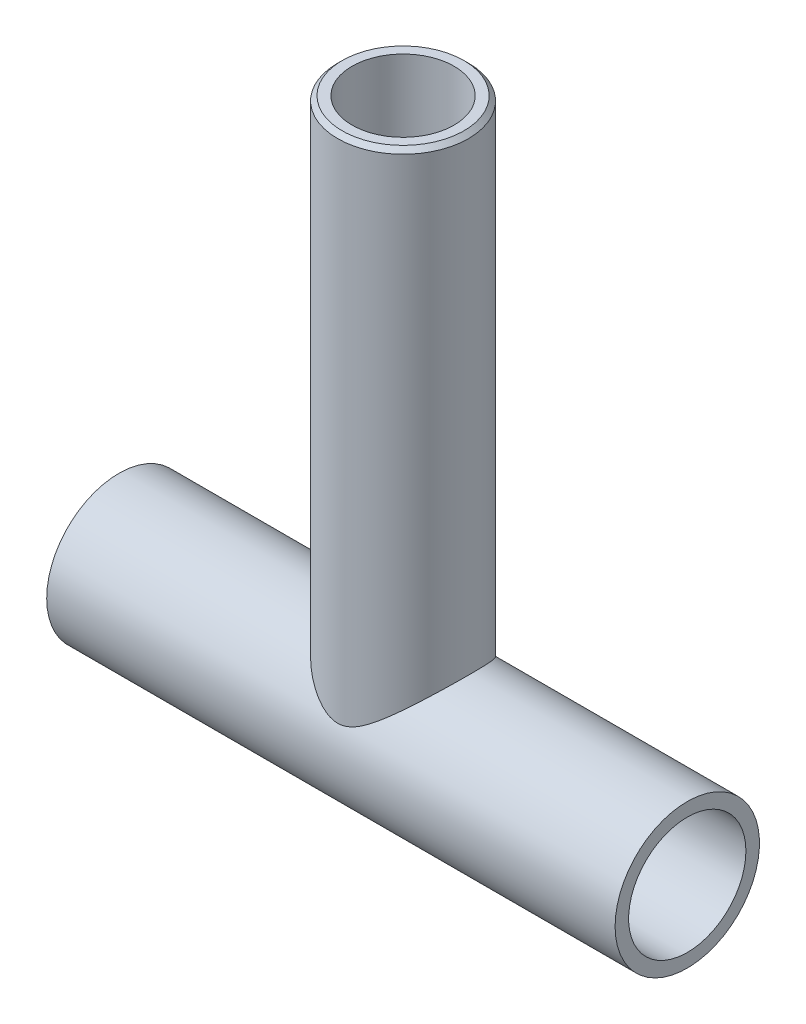
ISO-10303-21;
HEADER;
FILE_DESCRIPTION(('STEP AP214'),'2;1');
FILE_NAME('part.step','',(''),(''),'','','');
FILE_SCHEMA(('AUTOMOTIVE_DESIGN { 1 0 10303 214 1 1 1 1 }'));
ENDSEC;
DATA;
#1=APPLICATION_CONTEXT('core data for automotive mechanical design processes');
#2=APPLICATION_PROTOCOL_DEFINITION('international standard','automotive_design',2000,#1);
#3=PRODUCT_CONTEXT('',#1,'mechanical');
#4=PRODUCT('Part','Part','',(#3));
#5=PRODUCT_RELATED_PRODUCT_CATEGORY('part','',(#4));
#6=PRODUCT_DEFINITION_FORMATION('','',#4);
#7=PRODUCT_DEFINITION_CONTEXT('part definition',#1,'design');
#8=PRODUCT_DEFINITION('design','',#6,#7);
#9=PRODUCT_DEFINITION_SHAPE('','',#8);
#10=(LENGTH_UNIT() NAMED_UNIT(*) SI_UNIT(.MILLI.,.METRE.));
#11=(NAMED_UNIT(*) PLANE_ANGLE_UNIT() SI_UNIT($,.RADIAN.));
#12=(NAMED_UNIT(*) SI_UNIT($,.STERADIAN.) SOLID_ANGLE_UNIT());
#13=UNCERTAINTY_MEASURE_WITH_UNIT(LENGTH_MEASURE(1.E-05),#10,'distance_accuracy_value','');
#14=(GEOMETRIC_REPRESENTATION_CONTEXT(3) GLOBAL_UNCERTAINTY_ASSIGNED_CONTEXT((#13)) GLOBAL_UNIT_ASSIGNED_CONTEXT((#10,
#11,#12)) REPRESENTATION_CONTEXT('',''));
#15=CARTESIAN_POINT('',(0.,0.,0.));
#16=DIRECTION('',(0.,0.,1.));
#17=DIRECTION('',(1.,0.,0.));
#18=AXIS2_PLACEMENT_3D('',#15,#16,#17);
#19=CARTESIAN_POINT('',(63.,0.,0.));
#20=DIRECTION('',(-1.,0.,0.));
#21=DIRECTION('',(0.,0.,1.));
#22=AXIS2_PLACEMENT_3D('',#19,#20,#21);
#23=CYLINDRICAL_SURFACE('',#22,16.);
#24=CARTESIAN_POINT('',(0.,6.76387462923432,14.5));
#25=CARTESIAN_POINT('',(0.213106503792908,6.76387426027506,14.500000097715));
#26=CARTESIAN_POINT('',(0.426211669557894,6.77400596980977,14.4952868462218));
#27=CARTESIAN_POINT('',(0.850250078577055,6.81383250978955,14.4766072140147));
#28=CARTESIAN_POINT('',(1.06118211743942,6.84353765210637,14.462635955883));
#29=CARTESIAN_POINT('',(1.47956998334545,6.92074295345281,14.4258492811319));
#30=CARTESIAN_POINT('',(1.68701365344203,6.96829559726624,14.4030077725105));
#31=CARTESIAN_POINT('',(2.09674465987544,7.07865520921456,14.349090812948));
#32=CARTESIAN_POINT('',(2.29902923011031,7.14147017799707,14.3180110426567));
#33=CARTESIAN_POINT('',(2.79589434030382,7.31362361675102,14.2310986826402));
#34=CARTESIAN_POINT('',(3.08698679680445,7.43065614618229,14.1706072879024));
#35=CARTESIAN_POINT('',(3.65657563355297,7.68475433792021,14.0344342101829));
#36=CARTESIAN_POINT('',(3.93506309245354,7.82183390717843,13.9587419684152));
#37=CARTESIAN_POINT('',(4.48127770951268,8.11035966932465,13.7931085689821));
#38=CARTESIAN_POINT('',(4.74896577192432,8.26185237043818,13.7031206102714));
#39=CARTESIAN_POINT('',(5.27371571693012,8.57424409599208,13.5098515863986));
#40=CARTESIAN_POINT('',(5.53077912999804,8.73514175753576,13.4065724447018));
#41=CARTESIAN_POINT('',(6.00339768642967,9.04227742850193,13.2010201381042));
#42=CARTESIAN_POINT('',(6.22009001420747,9.18779513860972,13.1002724357533));
#43=CARTESIAN_POINT('',(6.64665622646743,9.48178329373746,12.8890877175343));
#44=CARTESIAN_POINT('',(6.85652927428842,9.63025409749843,12.778649518839));
#45=CARTESIAN_POINT('',(7.47666137171043,10.078105095198,12.4327755868639));
#46=CARTESIAN_POINT('',(7.87727776802894,10.3798202804318,12.1828485405839));
#47=CARTESIAN_POINT('',(8.65309260715036,10.9802626694049,11.6445905980305));
#48=CARTESIAN_POINT('',(9.02832131646188,11.2789930558446,11.356306691638));
#49=CARTESIAN_POINT('',(9.75289449650711,11.8669367669158,10.7404336277744));
#50=CARTESIAN_POINT('',(10.1022521200653,12.1561548854158,10.4128646677694));
#51=CARTESIAN_POINT('',(10.690218265419,12.6495850102227,9.80315150564094));
#52=CARTESIAN_POINT('',(10.9349377851665,12.8572141108463,9.52963998224606));
#53=CARTESIAN_POINT('',(11.4066946939557,13.2607594291064,8.95958547931639));
#54=CARTESIAN_POINT('',(11.6337323417941,13.4566758181636,8.66304283699814));
#55=CARTESIAN_POINT('',(12.0677464294349,13.8336172523172,8.04743005714582));
#56=CARTESIAN_POINT('',(12.2747503921503,14.0146626743321,7.72839189772187));
#57=CARTESIAN_POINT('',(12.6665680650511,14.3590816394182,7.06791283196703));
#58=CARTESIAN_POINT('',(12.8513866116238,14.5224590333203,6.72647683352175));
#59=CARTESIAN_POINT('',(13.1619216064567,14.7980449175525,6.09201787588593));
#60=CARTESIAN_POINT('',(13.2920955428782,14.9139806669115,5.80278924910979));
#61=CARTESIAN_POINT('',(13.5348277157801,15.1307162283295,5.21157357828352));
#62=CARTESIAN_POINT('',(13.6473897575471,15.2315193098136,4.90958930821867));
#63=CARTESIAN_POINT('',(13.8533304752261,15.4163128041576,4.29423526275439));
#64=CARTESIAN_POINT('',(13.9467154510691,15.5003087381646,3.9808692663507));
#65=CARTESIAN_POINT('',(14.1128705601577,15.6499780521918,3.34440430386484));
#66=CARTESIAN_POINT('',(14.1856404697758,15.7156512334508,3.02130523224252));
#67=CARTESIAN_POINT('',(14.3096617254889,15.8276879550243,2.36550801743083));
#68=CARTESIAN_POINT('',(14.3607743483021,15.8739269974027,2.032762157884));
#69=CARTESIAN_POINT('',(14.4398105459423,15.9454647354793,1.36227977845531));
#70=CARTESIAN_POINT('',(14.4677340617494,15.9707633778812,1.02454324587367));
#71=CARTESIAN_POINT('',(14.499809213937,15.9998256601027,0.347111449601173));
#72=CARTESIAN_POINT('',(14.5039676316892,16.0035954431829,0.00741677236505895));
#73=CARTESIAN_POINT('',(14.4884401667354,15.9895242851317,-0.670960329767769));
#74=CARTESIAN_POINT('',(14.4687560083663,15.9716849068126,-1.00964282609143));
#75=CARTESIAN_POINT('',(14.4091246662692,15.9176862002968,-1.64914487126617));
#76=CARTESIAN_POINT('',(14.3714125232963,15.8835480209219,-1.95034912816456));
#77=CARTESIAN_POINT('',(14.2776594245356,15.798770762149,-2.54750330712799));
#78=CARTESIAN_POINT('',(14.2216199638711,15.7481330287684,-2.84345365572571));
#79=CARTESIAN_POINT('',(14.0920565594649,15.6312276765842,-3.42836599584015));
#80=CARTESIAN_POINT('',(14.018530773554,15.5649584110182,-3.71732724752561));
#81=CARTESIAN_POINT('',(13.8550182970101,15.4178551763438,-4.28675060147192));
#82=CARTESIAN_POINT('',(13.7650306207413,15.3370203351435,-4.56721219365325));
#83=CARTESIAN_POINT('',(13.5647170680768,15.157489067613,-5.13253602163492));
#84=CARTESIAN_POINT('',(13.4535861044037,15.0580903172434,-5.4168890809781));
#85=CARTESIAN_POINT('',(13.2156756543061,14.845914811745,-5.97391761890783));
#86=CARTESIAN_POINT('',(13.0888900995299,14.7331328694144,-6.24658851349809));
#87=CARTESIAN_POINT('',(12.8210274774892,14.4956855953871,-6.77939210802337));
#88=CARTESIAN_POINT('',(12.679951513864,14.3710211814102,-7.03952577391441));
#89=CARTESIAN_POINT('',(12.384721425644,14.1112159071119,-7.54684356354088));
#90=CARTESIAN_POINT('',(12.2305645304983,13.9760728279268,-7.79402492594683));
#91=CARTESIAN_POINT('',(11.8259818530913,13.6231244966875,-8.40182984410861));
#92=CARTESIAN_POINT('',(11.5675953441124,13.3992525373879,-8.75367881539753));
#93=CARTESIAN_POINT('',(11.0263764597689,12.9348994681484,-9.42632223681754));
#94=CARTESIAN_POINT('',(10.7435329212402,12.6944107838416,-9.74710236275059));
#95=CARTESIAN_POINT('',(10.1550954547104,12.2004213596791,-10.3588006021595));
#96=CARTESIAN_POINT('',(9.84942877267946,11.9468798844439,-10.6496155161137));
#97=CARTESIAN_POINT('',(9.21803135073654,11.4319146866842,-11.2006010603365));
#98=CARTESIAN_POINT('',(8.89230486675471,11.1704926420856,-11.4607781569108));
#99=CARTESIAN_POINT('',(8.21338257578284,10.6378661623419,-11.9570689342917));
#100=CARTESIAN_POINT('',(7.85971026912562,10.366578721566,-12.1924400198953));
#101=CARTESIAN_POINT('',(7.13162305503209,9.82599601407752,-12.6321430654798));
#102=CARTESIAN_POINT('',(6.75719645527997,9.5567019692287,-12.8364572814046));
#103=CARTESIAN_POINT('',(6.17959051246931,9.16067591304676,-13.1190057824215));
#104=CARTESIAN_POINT('',(5.98470504938329,9.03018037560389,-13.2090816428175));
#105=CARTESIAN_POINT('',(5.58904499825254,8.77295671275152,-13.3812983813893));
#106=CARTESIAN_POINT('',(5.38827125668073,8.64622805105548,-13.4634403928817));
#107=CARTESIAN_POINT('',(4.98057441587202,8.39821270082805,-13.6195254615117));
#108=CARTESIAN_POINT('',(4.77365782704448,8.27692057027794,-13.693476831846));
#109=CARTESIAN_POINT('',(4.35298066278277,8.04164340281242,-13.8329553722104));
#110=CARTESIAN_POINT('',(4.13922199418546,7.92765635615777,-13.8984848642581));
#111=CARTESIAN_POINT('',(3.73771564021056,7.72626651033624,-14.0112815981648));
#112=CARTESIAN_POINT('',(3.55102330413233,7.63747124634774,-14.05980753464));
#113=CARTESIAN_POINT('',(3.17202788942635,7.46879954976692,-14.1501301230876));
#114=CARTESIAN_POINT('',(2.97972495544082,7.38892288750726,-14.1919269483571));
#115=CARTESIAN_POINT('',(2.5898021647618,7.24048694902486,-14.2682270892328));
#116=CARTESIAN_POINT('',(2.39219382963775,7.17190514354226,-14.3027449633374));
#117=CARTESIAN_POINT('',(1.99158856545672,7.04841651430071,-14.364003229359));
#118=CARTESIAN_POINT('',(1.78859387776333,6.99350409821784,-14.3907468025967));
#119=CARTESIAN_POINT('',(1.40929325611964,6.90705525611353,-14.4324124768914));
#120=CARTESIAN_POINT('',(1.23364136384513,6.87323045064242,-14.4485157278273));
#121=CARTESIAN_POINT('',(0.879918351293098,6.81863336279455,-14.4743621607067));
#122=CARTESIAN_POINT('',(0.701848526330292,6.79785435319715,-14.4841086207063));
#123=CARTESIAN_POINT('',(0.344489255915203,6.77030037499436,-14.4970089779193));
#124=CARTESIAN_POINT('',(0.165200651088939,6.76351657670895,-14.5001670318198));
#125=CARTESIAN_POINT('',(-0.193343332524866,6.7642619574241,-14.4998193128256));
#126=CARTESIAN_POINT('',(-0.372598710398277,6.77179148453047,-14.4963133778601));
#127=CARTESIAN_POINT('',(-0.729195741159,6.80075252026457,-14.4827488786959));
#128=CARTESIAN_POINT('',(-0.906541441145477,6.82214357259967,-14.4727093830043));
#129=CARTESIAN_POINT('',(-1.25875466915726,6.87780194713168,-14.4463413067313));
#130=CARTESIAN_POINT('',(-1.43362110763765,6.91207475885361,-14.4300100448574));
#131=CARTESIAN_POINT('',(-1.95359632775972,7.03227598225942,-14.372022603397));
#132=CARTESIAN_POINT('',(-2.29376793961806,7.13555766791333,-14.3213855943561));
#133=CARTESIAN_POINT('',(-2.92686096781752,7.36458883171738,-14.2048466977219));
#134=CARTESIAN_POINT('',(-3.22124845810287,7.48739242638036,-14.1407805388153));
#135=CARTESIAN_POINT('',(-3.79727575170309,7.75267588707294,-13.997099940092));
#136=CARTESIAN_POINT('',(-4.07890430535746,7.89517268507324,-13.9174720958704));
#137=CARTESIAN_POINT('',(-4.6313293881592,8.19420797496602,-13.7435443459328));
#138=CARTESIAN_POINT('',(-4.90207834363326,8.35080009668665,-13.6491873055604));
#139=CARTESIAN_POINT('',(-5.43275790977113,8.67297270413549,-13.446774748396));
#140=CARTESIAN_POINT('',(-5.69269058903073,8.83855145709686,-13.3387218670543));
#141=CARTESIAN_POINT('',(-6.16737687619497,9.15201493171615,-13.1252217614681));
#142=CARTESIAN_POINT('',(-6.38339442988318,9.29916648431295,-13.0214937377364));
#143=CARTESIAN_POINT('',(-6.80864192151649,9.59606633018912,-12.804272018622));
#144=CARTESIAN_POINT('',(-7.01787106928181,9.74581492267647,-12.6907771919459));
#145=CARTESIAN_POINT('',(-7.63606443038507,10.1970413859704,-12.3355876115492));
#146=CARTESIAN_POINT('',(-8.0353817330149,10.5003966886243,-12.079256794081));
#147=CARTESIAN_POINT('',(-8.80824736742344,11.103025262615,-11.5277794351375));
#148=CARTESIAN_POINT('',(-9.18183146588698,11.4023037161269,-11.2326884966395));
#149=CARTESIAN_POINT('',(-9.90260228242477,11.990336396542,-10.6027045311302));
#150=CARTESIAN_POINT('',(-10.2498028183668,12.2790960906001,-10.2678325775148));
#151=CARTESIAN_POINT('',(-10.8287143931685,12.7668943501705,-9.64980075775224));
#152=CARTESIAN_POINT('',(-11.0670032516258,12.9697600505924,-9.37579296350379));
#153=CARTESIAN_POINT('',(-11.5260445543024,13.3635991950989,-8.80535636321046));
#154=CARTESIAN_POINT('',(-11.746797455146,13.5545729488137,-8.50892814137081));
#155=CARTESIAN_POINT('',(-12.1684203037804,13.9215556066229,-7.89419228763193));
#156=CARTESIAN_POINT('',(-12.3693166838626,14.0975843596911,-7.57591472450687));
#157=CARTESIAN_POINT('',(-12.7491209947818,14.4319777017017,-6.91767312040619));
#158=CARTESIAN_POINT('',(-12.9280334701841,14.5903459408401,-6.57771358372778));
#159=CARTESIAN_POINT('',(-13.2291838676773,14.8579103582014,-5.9444870612913));
#160=CARTESIAN_POINT('',(-13.3557094172147,14.9707109787285,-5.65477660419279));
#161=CARTESIAN_POINT('',(-13.591100396364,15.1810809933934,-5.06293961194618));
#162=CARTESIAN_POINT('',(-13.6999695691956,15.2786536157596,-4.76081572556045));
#163=CARTESIAN_POINT('',(-13.8985136829743,15.4569328887814,-4.14557087295186));
#164=CARTESIAN_POINT('',(-13.9881949749029,15.537645119835,-3.83245358549585));
#165=CARTESIAN_POINT('',(-14.1469792059091,15.6807473145081,-3.19691152205954));
#166=CARTESIAN_POINT('',(-14.2160819291945,15.7431370859937,-2.87448664851642));
#167=CARTESIAN_POINT('',(-14.3328268515769,15.8486370417616,-2.22059050394537));
#168=CARTESIAN_POINT('',(-14.3803375489444,15.8916290770573,-1.88907650359685));
#169=CARTESIAN_POINT('',(-14.4523559329252,15.9568279251188,-1.22151613778489));
#170=CARTESIAN_POINT('',(-14.4768635605083,15.9790346845457,-0.885469760692765));
#171=CARTESIAN_POINT('',(-14.5023690601791,16.0021460830255,-0.211834543778902));
#172=CARTESIAN_POINT('',(-14.5033727153758,16.0030559621364,0.12575389617418));
#173=CARTESIAN_POINT('',(-14.4818618322025,15.9835634556487,0.799545095514394));
#174=CARTESIAN_POINT('',(-14.4593488474294,15.9631624779246,1.13574794496576));
#175=CARTESIAN_POINT('',(-14.3945499536511,15.9044931202567,1.77175170686412));
#176=CARTESIAN_POINT('',(-14.3543703165588,15.8681285611222,2.07194806858556));
#177=CARTESIAN_POINT('',(-14.2558344463599,15.7790485100828,2.66684749835811));
#178=CARTESIAN_POINT('',(-14.1974796322746,15.7263342946735,2.96155099335998));
#179=CARTESIAN_POINT('',(-14.0634598369305,15.6054498819862,3.54377761681484));
#180=CARTESIAN_POINT('',(-13.9877927696833,15.5372778221699,3.8312998753517));
#181=CARTESIAN_POINT('',(-13.8201856488024,15.3865586753128,4.39769376172491));
#182=CARTESIAN_POINT('',(-13.728244604829,15.3040107134428,4.67656486188743));
#183=CARTESIAN_POINT('',(-13.5235232850604,15.1206313812442,5.2401596372231));
#184=CARTESIAN_POINT('',(-13.4098521602837,15.0190245737649,5.52430651236676));
#185=CARTESIAN_POINT('',(-13.1668979041828,14.8025052996182,6.0807077504481));
#186=CARTESIAN_POINT('',(-13.0376087060506,14.6875876631048,6.35295743566543));
#187=CARTESIAN_POINT('',(-12.7647908808156,14.4459638615707,6.88472270703139));
#188=CARTESIAN_POINT('',(-12.6212638758336,14.3192590395722,7.14423973879421));
#189=CARTESIAN_POINT('',(-12.3211818540232,14.0554761836729,7.65016464347426));
#190=CARTESIAN_POINT('',(-12.1646240766721,13.9183959523388,7.89656972045331));
#191=CARTESIAN_POINT('',(-11.7532217515037,13.5599867521119,8.50344043991303));
#192=CARTESIAN_POINT('',(-11.4903566159551,13.3325968907076,8.8549380871379));
#193=CARTESIAN_POINT('',(-10.9401102333026,12.8614070615257,9.52641542833879));
#194=CARTESIAN_POINT('',(-10.6527176212492,12.61759949767,9.84638036186716));
#195=CARTESIAN_POINT('',(-10.054997954907,12.1171833746423,10.4560952996038));
#196=CARTESIAN_POINT('',(-9.74459251299097,11.8605321308261,10.7457330870293));
#197=CARTESIAN_POINT('',(-9.10355597150415,11.3397416033152,11.2939424709808));
#198=CARTESIAN_POINT('',(-8.77292949925465,11.0756040401366,11.5525211351398));
#199=CARTESIAN_POINT('',(-8.08376581778551,10.5380061611058,12.0451891616078));
#200=CARTESIAN_POINT('',(-7.72474252311568,10.2644762137756,12.2785209995793));
#201=CARTESIAN_POINT('',(-6.98545825827002,9.72026813177744,12.7136776476981));
#202=CARTESIAN_POINT('',(-6.60518366960803,9.44959196105608,12.9154819322461));
#203=CARTESIAN_POINT('',(-6.01830075704185,9.05259627745457,13.193810175619));
#204=CARTESIAN_POINT('',(-5.82025364293689,8.92196670130326,13.282402444063));
#205=CARTESIAN_POINT('',(-5.41805648290586,8.66494930210597,13.4514784098577));
#206=CARTESIAN_POINT('',(-5.21390741844746,8.53856080377226,13.5319634022182));
#207=CARTESIAN_POINT('',(-4.79923564719897,8.291859096045,13.6845199491385));
#208=CARTESIAN_POINT('',(-4.58872057582219,8.17153903701696,13.7566011156726));
#209=CARTESIAN_POINT('',(-4.16057858272913,7.93902382672931,13.8920835591094));
#210=CARTESIAN_POINT('',(-3.94295407224925,7.8268259614262,13.9554877418045));
#211=CARTESIAN_POINT('',(-3.52943385266946,7.6274908713711,14.0652965057959));
#212=CARTESIAN_POINT('',(-3.33449498618497,7.53900488126298,14.1128404667748));
#213=CARTESIAN_POINT('',(-2.93853917338559,7.3724322586232,14.2005670009669));
#214=CARTESIAN_POINT('',(-2.73752177520663,7.29434640155702,14.2407490253356));
#215=CARTESIAN_POINT('',(-2.33019616317905,7.15147529240527,14.3130289312706));
#216=CARTESIAN_POINT('',(-2.12391029899289,7.08664185632042,14.3451561990177));
#217=CARTESIAN_POINT('',(-1.70595100396461,6.97279759001912,14.4008376514392));
#218=CARTESIAN_POINT('',(-1.49428097125852,6.92377703455765,14.4243971066339));
#219=CARTESIAN_POINT('',(-1.06996498402539,6.84485924859087,14.4620124094482));
#220=CARTESIAN_POINT('',(-0.857386112782075,6.81467481983981,14.4762111806309));
#221=CARTESIAN_POINT('',(-0.429871141014916,6.77418205784585,14.4952052286503));
#222=CARTESIAN_POINT('',(-0.214934889964396,6.76387500135914,14.4999999014467));
#223=CARTESIAN_POINT('',(0.,6.76387462923432,14.5));
#224=B_SPLINE_CURVE_WITH_KNOTS('',3,(#24,#25,#26,#27,#28,#29,#30,#31,#32,#33,#34,#35,#36,#37,
#38,#39,#40,#41,#42,#43,#44,#45,#46,#47,#48,#49,#50,#51,#52,#53,#54,#55,#56,#57,#58,#59,#60,#61,
#62,#63,#64,#65,#66,#67,#68,#69,#70,#71,#72,#73,#74,#75,#76,#77,#78,#79,#80,#81,#82,#83,#84,#85,
#86,#87,#88,#89,#90,#91,#92,#93,#94,#95,#96,#97,#98,#99,#100,#101,#102,#103,#104,#105,#106,#107,
#108,#109,#110,#111,#112,#113,#114,#115,#116,#117,#118,#119,#120,#121,#122,#123,#124,#125,#126,
#127,#128,#129,#130,#131,#132,#133,#134,#135,#136,#137,#138,#139,#140,#141,#142,#143,#144,#145,
#146,#147,#148,#149,#150,#151,#152,#153,#154,#155,#156,#157,#158,#159,#160,#161,#162,#163,#164,
#165,#166,#167,#168,#169,#170,#171,#172,#173,#174,#175,#176,#177,#178,#179,#180,#181,#182,#183,
#184,#185,#186,#187,#188,#189,#190,#191,#192,#193,#194,#195,#196,#197,#198,#199,#200,#201,#202,
#203,#204,#205,#206,#207,#208,#209,#210,#211,#212,#213,#214,#215,#216,#217,#218,#219,#220,#221,
#222,#223),.UNSPECIFIED.,.T.,.F.,(4,2,2,2,2,2,2,2,2,2,2,2,2,2,2,2,2,2,2,2,2,2,2,2,2,2,2,2,2,2,2,
2,2,2,2,2,2,2,2,2,2,2,2,2,2,2,2,2,2,2,2,2,2,2,2,2,2,2,2,2,2,2,2,2,2,2,2,2,2,2,2,2,2,2,2,2,2,2,2,
2,2,2,2,2,2,2,2,2,2,2,2,2,2,2,2,2,2,2,2,4),(0.,0.639036074403063,1.27840908164768,
1.91967723848705,2.5612822818632,3.51814714334591,4.47567897399327,5.43641272743009,
6.39700760199883,7.23608646141774,8.07526788210603,9.75422560926455,11.4311451133442,
13.1072061360235,14.3711878529484,15.6351510664214,16.8973523947632,18.1592780634845,
19.1714230555817,20.1833490572494,21.1949420935589,22.2065461029804,23.22453530541,
24.242527098763,25.2602283936049,26.2778560909054,27.1932209531809,28.1085111595739,
29.0238978337468,29.9393393335394,30.9016241813259,31.8642832276164,32.8268679849413,
33.7896571297534,35.2592411049376,36.7294994339281,38.2046630004306,39.6795146641666,
41.1903747254837,42.7020947841892,43.4556484112356,44.2090942366545,44.9617681958405,
45.7142341861259,46.350980433195,46.987710279312,47.6231542746303,48.2583378727558,
48.7965986335166,49.3345816052164,49.872225055641,50.4098815819367,50.9459759270866,
51.482298986812,52.5558789978068,53.5305687788268,54.5061018608411,55.4855176471109,
56.4647452525951,57.3080854070406,58.1515233777975,59.8389882614652,61.5240583197778,
63.208239684969,64.4550864618153,65.7019007609732,66.9470323374505,68.1919060827549,
69.1979240436603,70.2037284452963,71.2091994197378,72.2146809374326,73.2262066612143,
74.237734980754,75.2490144130071,76.2602270406017,77.1743384322352,78.0883784727898,
79.0025287059413,79.9167345881129,80.8832030554844,81.85004816009,82.8167832377626,
83.7837236386342,85.2644860000952,86.7459382457725,88.2326916538938,89.7191061015631,
91.2420306484843,92.7659425804158,93.5255031988348,94.2849422963528,95.0435040734717,
95.8018111946724,96.4593219379503,97.1168816798111,97.7720063441535,98.4267273218145,
99.0712047284712,99.7157235295894),.UNSPECIFIED.);
#225=CARTESIAN_POINT('',(0.,6.76387462923432,14.5));
#226=VERTEX_POINT('',#225);
#227=EDGE_CURVE('E74',#226,#226,#224,.T.);
#228=ORIENTED_EDGE('',*,*,#227,.F.);
#229=EDGE_LOOP('',(#228));
#230=FACE_BOUND('',#229,.T.);
#231=CARTESIAN_POINT('',(63.,0.,0.));
#232=DIRECTION('',(-1.,0.,0.));
#233=DIRECTION('',(0.,0.,1.));
#234=AXIS2_PLACEMENT_3D('',#231,#232,#233);
#235=CIRCLE('',#234,16.);
#236=CARTESIAN_POINT('',(63.,0.,16.));
#237=VERTEX_POINT('',#236);
#238=EDGE_CURVE('E71',#237,#237,#235,.T.);
#239=ORIENTED_EDGE('',*,*,#238,.T.);
#240=EDGE_LOOP('',(#239));
#241=FACE_BOUND('',#240,.T.);
#242=CARTESIAN_POINT('',(-63.,0.,0.));
#243=DIRECTION('',(-1.,0.,0.));
#244=DIRECTION('',(0.,0.,1.));
#245=AXIS2_PLACEMENT_3D('',#242,#243,#244);
#246=CIRCLE('',#245,16.);
#247=CARTESIAN_POINT('',(-63.,0.,16.));
#248=VERTEX_POINT('',#247);
#249=EDGE_CURVE('E68',#248,#248,#246,.T.);
#250=ORIENTED_EDGE('',*,*,#249,.F.);
#251=EDGE_LOOP('',(#250));
#252=FACE_BOUND('',#251,.T.);
#253=ADVANCED_FACE('F35',(#230,#241,#252),#23,.T.);
#254=CARTESIAN_POINT('',(63.,16.,0.));
#255=DIRECTION('',(1.,0.,0.));
#256=DIRECTION('',(0.,0.,-1.));
#257=AXIS2_PLACEMENT_3D('',#254,#255,#256);
#258=PLANE('',#257);
#259=CARTESIAN_POINT('',(63.,0.,0.));
#260=DIRECTION('',(1.,0.,0.));
#261=DIRECTION('',(0.,0.,-1.));
#262=AXIS2_PLACEMENT_3D('',#259,#260,#261);
#263=CIRCLE('',#262,13.);
#264=CARTESIAN_POINT('',(63.,0.,-13.));
#265=VERTEX_POINT('',#264);
#266=EDGE_CURVE('E58',#265,#265,#263,.T.);
#267=ORIENTED_EDGE('',*,*,#266,.F.);
#268=EDGE_LOOP('',(#267));
#269=FACE_BOUND('',#268,.T.);
#270=ORIENTED_EDGE('',*,*,#238,.F.);
#271=EDGE_LOOP('',(#270));
#272=FACE_BOUND('',#271,.T.);
#273=ADVANCED_FACE('F98',(#269,#272),#258,.T.);
#274=CARTESIAN_POINT('',(-63.,0.,0.));
#275=DIRECTION('',(-1.,0.,0.));
#276=DIRECTION('',(0.,0.,1.));
#277=AXIS2_PLACEMENT_3D('',#274,#275,#276);
#278=PLANE('',#277);
#279=CARTESIAN_POINT('',(-63.,0.,0.));
#280=DIRECTION('',(1.,0.,0.));
#281=DIRECTION('',(0.,0.,-1.));
#282=AXIS2_PLACEMENT_3D('',#279,#280,#281);
#283=CIRCLE('',#282,13.);
#284=CARTESIAN_POINT('',(-63.,0.,-13.));
#285=VERTEX_POINT('',#284);
#286=EDGE_CURVE('E61',#285,#285,#283,.T.);
#287=ORIENTED_EDGE('',*,*,#286,.T.);
#288=EDGE_LOOP('',(#287));
#289=FACE_BOUND('',#288,.T.);
#290=ORIENTED_EDGE('',*,*,#249,.T.);
#291=EDGE_LOOP('',(#290));
#292=FACE_BOUND('',#291,.T.);
#293=ADVANCED_FACE('F96',(#289,#292),#278,.T.);
#294=CARTESIAN_POINT('',(63.,0.,0.));
#295=DIRECTION('',(1.,0.,0.));
#296=DIRECTION('',(0.,0.,-1.));
#297=AXIS2_PLACEMENT_3D('',#294,#295,#296);
#298=CYLINDRICAL_SURFACE('',#297,13.);
#299=CARTESIAN_POINT('',(0.,0.,0.));
#300=DIRECTION('',(-0.707106781186547,0.707106781186547,0.));
#301=DIRECTION('',(0.707106781186547,0.707106781186547,0.));
#302=AXIS2_PLACEMENT_3D('',#299,#300,#301);
#303=ELLIPSE('',#302,18.3847763108502,13.);
#304=CARTESIAN_POINT('',(0.,0.,-13.));
#305=VERTEX_POINT('',#304);
#306=CARTESIAN_POINT('',(0.,0.,13.));
#307=VERTEX_POINT('',#306);
#308=EDGE_CURVE('E51',#305,#307,#303,.F.);
#309=ORIENTED_EDGE('',*,*,#308,.F.);
#310=CARTESIAN_POINT('',(0.,0.,0.));
#311=DIRECTION('',(0.707106781186547,0.707106781186547,0.));
#312=DIRECTION('',(-0.707106781186547,0.707106781186547,0.));
#313=AXIS2_PLACEMENT_3D('',#310,#311,#312);
#314=ELLIPSE('',#313,18.3847763108502,13.);
#315=EDGE_CURVE('E49',#307,#305,#314,.F.);
#316=ORIENTED_EDGE('',*,*,#315,.F.);
#317=EDGE_LOOP('',(#309,#316));
#318=FACE_BOUND('',#317,.T.);
#319=ORIENTED_EDGE('',*,*,#286,.F.);
#320=EDGE_LOOP('',(#319));
#321=FACE_BOUND('',#320,.T.);
#322=ORIENTED_EDGE('',*,*,#266,.T.);
#323=EDGE_LOOP('',(#322));
#324=FACE_BOUND('',#323,.T.);
#325=ADVANCED_FACE('F56',(#318,#321,#324),#298,.F.);
#326=CARTESIAN_POINT('',(0.,120.,0.));
#327=DIRECTION('',(0.,-1.,0.));
#328=DIRECTION('',(0.,0.,-1.));
#329=AXIS2_PLACEMENT_3D('',#326,#327,#328);
#330=PLANE('',#329);
#331=CARTESIAN_POINT('',(0.,120.,0.));
#332=DIRECTION('',(0.,-1.,0.));
#333=DIRECTION('',(0.,0.,-1.));
#334=AXIS2_PLACEMENT_3D('',#331,#332,#333);
#335=CIRCLE('',#334,13.5000000000025);
#336=CARTESIAN_POINT('',(0.,120.,-13.5000000000025));
#337=VERTEX_POINT('',#336);
#338=EDGE_CURVE('E82',#337,#337,#335,.F.);
#339=ORIENTED_EDGE('',*,*,#338,.T.);
#340=EDGE_LOOP('',(#339));
#341=FACE_BOUND('',#340,.T.);
#342=CARTESIAN_POINT('',(0.,120.,0.));
#343=DIRECTION('',(0.,1.,0.));
#344=DIRECTION('',(0.,0.,-1.));
#345=AXIS2_PLACEMENT_3D('',#342,#343,#344);
#346=CIRCLE('',#345,11.3155);
#347=CARTESIAN_POINT('',(0.,120.,-11.3155));
#348=VERTEX_POINT('',#347);
#349=EDGE_CURVE('E64',#348,#348,#346,.T.);
#350=ORIENTED_EDGE('',*,*,#349,.F.);
#351=EDGE_LOOP('',(#350));
#352=FACE_BOUND('',#351,.T.);
#353=ADVANCED_FACE('F91',(#341,#352),#330,.F.);
#354=CARTESIAN_POINT('',(0.,-16.002,0.));
#355=DIRECTION('',(0.,1.,0.));
#356=DIRECTION('',(0.,0.,1.));
#357=AXIS2_PLACEMENT_3D('',#354,#355,#356);
#358=CYLINDRICAL_SURFACE('',#357,14.5);
#359=CARTESIAN_POINT('',(0.,118.999999999997,0.));
#360=DIRECTION('',(0.,-1.,0.));
#361=DIRECTION('',(0.,0.,-1.));
#362=AXIS2_PLACEMENT_3D('',#359,#360,#361);
#363=CIRCLE('',#362,14.5);
#364=CARTESIAN_POINT('',(0.,118.999999999997,-14.5));
#365=VERTEX_POINT('',#364);
#366=EDGE_CURVE('E43',#365,#365,#363,.T.);
#367=ORIENTED_EDGE('',*,*,#366,.T.);
#368=EDGE_LOOP('',(#367));
#369=FACE_BOUND('',#368,.T.);
#370=ORIENTED_EDGE('',*,*,#227,.T.);
#371=EDGE_LOOP('',(#370));
#372=FACE_BOUND('',#371,.T.);
#373=ADVANCED_FACE('F86',(#369,#372),#358,.T.);
#374=CARTESIAN_POINT('',(0.,-16.001,0.));
#375=DIRECTION('',(0.,1.,0.));
#376=DIRECTION('',(0.,0.,1.));
#377=AXIS2_PLACEMENT_3D('',#374,#375,#376);
#378=CYLINDRICAL_SURFACE('',#377,13.);
#379=CARTESIAN_POINT('',(0.,15.6816210776405,0.));
#380=DIRECTION('',(0.,1.,0.));
#381=DIRECTION('',(0.,0.,1.));
#382=AXIS2_PLACEMENT_3D('',#379,#380,#381);
#383=CIRCLE('',#382,13.);
#384=CARTESIAN_POINT('',(0.,15.6816210776405,13.));
#385=VERTEX_POINT('',#384);
#386=EDGE_CURVE('E11',#385,#385,#383,.T.);
#387=ORIENTED_EDGE('',*,*,#386,.T.);
#388=EDGE_LOOP('',(#387));
#389=FACE_BOUND('',#388,.T.);
#390=ORIENTED_EDGE('',*,*,#315,.T.);
#391=ORIENTED_EDGE('',*,*,#308,.T.);
#392=EDGE_LOOP('',(#390,#391));
#393=FACE_BOUND('',#392,.T.);
#394=ADVANCED_FACE('F52',(#389,#393),#378,.F.);
#395=CARTESIAN_POINT('',(0.,0.184499999999976,0.));
#396=DIRECTION('',(0.,1.,0.));
#397=DIRECTION('',(0.,0.,1.));
#398=AXIS2_PLACEMENT_3D('',#395,#396,#397);
#399=CYLINDRICAL_SURFACE('',#398,11.3155);
#400=CARTESIAN_POINT('',(0.,18.5,0.));
#401=DIRECTION('',(0.,-1.,0.));
#402=DIRECTION('',(0.,0.,-1.));
#403=AXIS2_PLACEMENT_3D('',#400,#401,#402);
#404=CIRCLE('',#403,11.3155);
#405=CARTESIAN_POINT('',(0.,18.5,-11.3155));
#406=VERTEX_POINT('',#405);
#407=EDGE_CURVE('E54',#406,#406,#404,.T.);
#408=ORIENTED_EDGE('',*,*,#407,.T.);
#409=EDGE_LOOP('',(#408));
#410=FACE_BOUND('',#409,.T.);
#411=ORIENTED_EDGE('',*,*,#349,.T.);
#412=EDGE_LOOP('',(#411));
#413=FACE_BOUND('',#412,.T.);
#414=ADVANCED_FACE('F135',(#410,#413),#399,.F.);
#415=CARTESIAN_POINT('',(0.,120.,0.));
#416=DIRECTION('',(0.,-1.,0.));
#417=DIRECTION('',(0.,0.,-1.));
#418=AXIS2_PLACEMENT_3D('',#415,#416,#417);
#419=CONICAL_SURFACE('',#418,13.5000000000025,0.785398163394903);
#420=ORIENTED_EDGE('',*,*,#366,.F.);
#421=EDGE_LOOP('',(#420));
#422=FACE_BOUND('',#421,.T.);
#423=ORIENTED_EDGE('',*,*,#338,.F.);
#424=EDGE_LOOP('',(#423));
#425=FACE_BOUND('',#424,.T.);
#426=ADVANCED_FACE('F140',(#422,#425),#419,.T.);
#427=CARTESIAN_POINT('',(0.,15.6816210776405,0.));
#428=DIRECTION('',(0.,1.,0.));
#429=DIRECTION('',(0.,0.,1.));
#430=AXIS2_PLACEMENT_3D('',#427,#428,#429);
#431=TOROIDAL_SURFACE('',#430,9.8,3.2);
#432=ORIENTED_EDGE('',*,*,#407,.F.);
#433=EDGE_LOOP('',(#432));
#434=FACE_BOUND('',#433,.T.);
#435=ORIENTED_EDGE('',*,*,#386,.F.);
#436=EDGE_LOOP('',(#435));
#437=FACE_BOUND('',#436,.T.);
#438=ADVANCED_FACE('F37',(#434,#437),#431,.F.);
#439=CLOSED_SHELL('',(#253,#273,#293,#325,#353,#373,#394,#414,#426,#438));
#440=MANIFOLD_SOLID_BREP('B2',#439);
#441=ADVANCED_BREP_SHAPE_REPRESENTATION('',(#18,#440),#14);
#442=SHAPE_DEFINITION_REPRESENTATION(#9,#441);
ENDSEC;
END-ISO-10303-21;
